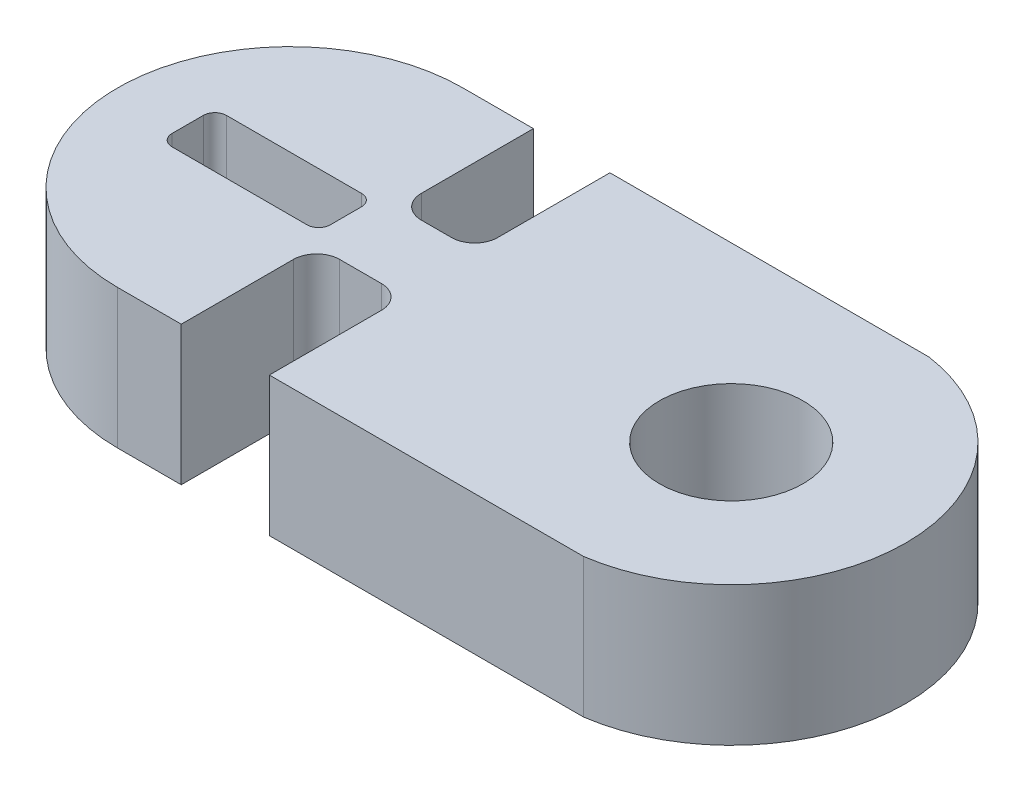
ISO-10303-21;
HEADER;
FILE_DESCRIPTION(('STEP AP214'),'2;1');
FILE_NAME('part.step','',(''),(''),'','','');
FILE_SCHEMA(('AUTOMOTIVE_DESIGN { 1 0 10303 214 1 1 1 1 }'));
ENDSEC;
DATA;
#1=APPLICATION_CONTEXT('core data for automotive mechanical design processes');
#2=APPLICATION_PROTOCOL_DEFINITION('international standard','automotive_design',2000,#1);
#3=PRODUCT_CONTEXT('',#1,'mechanical');
#4=PRODUCT('Part','Part','',(#3));
#5=PRODUCT_RELATED_PRODUCT_CATEGORY('part','',(#4));
#6=PRODUCT_DEFINITION_FORMATION('','',#4);
#7=PRODUCT_DEFINITION_CONTEXT('part definition',#1,'design');
#8=PRODUCT_DEFINITION('design','',#6,#7);
#9=PRODUCT_DEFINITION_SHAPE('','',#8);
#10=(LENGTH_UNIT() NAMED_UNIT(*) SI_UNIT(.MILLI.,.METRE.));
#11=(NAMED_UNIT(*) PLANE_ANGLE_UNIT() SI_UNIT($,.RADIAN.));
#12=(NAMED_UNIT(*) SI_UNIT($,.STERADIAN.) SOLID_ANGLE_UNIT());
#13=UNCERTAINTY_MEASURE_WITH_UNIT(LENGTH_MEASURE(1.E-05),#10,'distance_accuracy_value','');
#14=(GEOMETRIC_REPRESENTATION_CONTEXT(3) GLOBAL_UNCERTAINTY_ASSIGNED_CONTEXT((#13)) GLOBAL_UNIT_ASSIGNED_CONTEXT((#10,
#11,#12)) REPRESENTATION_CONTEXT('',''));
#15=CARTESIAN_POINT('',(0.,0.,0.));
#16=DIRECTION('',(0.,0.,1.));
#17=DIRECTION('',(1.,0.,0.));
#18=AXIS2_PLACEMENT_3D('',#15,#16,#17);
#19=CARTESIAN_POINT('',(-10.05,6.,0.));
#20=DIRECTION('',(0.,1.,0.));
#21=DIRECTION('',(0.,0.,1.));
#22=AXIS2_PLACEMENT_3D('',#19,#20,#21);
#23=PLANE('',#22);
#24=DIRECTION('',(0.,0.,-1.));
#25=VECTOR('',#24,1.);
#26=CARTESIAN_POINT('',(-7.79626507803803,6.,1.02582435237344));
#27=LINE('',#26,#25);
#28=CARTESIAN_POINT('',(-7.79626507803803,6.,0.525824352373436));
#29=VERTEX_POINT('',#28);
#30=CARTESIAN_POINT('',(-7.79626507803803,6.,-0.824245982154812));
#31=VERTEX_POINT('',#30);
#32=EDGE_CURVE('E305',#29,#31,#27,.T.);
#33=ORIENTED_EDGE('',*,*,#32,.F.);
#34=CARTESIAN_POINT('',(-8.29626507803803,6.,0.525824352373436));
#35=DIRECTION('',(0.,1.,0.));
#36=DIRECTION('',(0.,0.,1.));
#37=AXIS2_PLACEMENT_3D('',#34,#35,#36);
#38=CIRCLE('',#37,0.5);
#39=CARTESIAN_POINT('',(-8.29626507803803,6.,1.02582435237344));
#40=VERTEX_POINT('',#39);
#41=EDGE_CURVE('E290',#29,#40,#38,.F.);
#42=ORIENTED_EDGE('',*,*,#41,.T.);
#43=DIRECTION('',(1.,0.,0.));
#44=VECTOR('',#43,1.);
#45=CARTESIAN_POINT('',(-14.6226598592866,6.,1.02582435237344));
#46=LINE('',#45,#44);
#47=CARTESIAN_POINT('',(-14.1226598592866,6.,1.02582435237344));
#48=VERTEX_POINT('',#47);
#49=EDGE_CURVE('E330',#48,#40,#46,.T.);
#50=ORIENTED_EDGE('',*,*,#49,.F.);
#51=CARTESIAN_POINT('',(-14.1226598592866,6.,0.525824352373436));
#52=DIRECTION('',(0.,1.,0.));
#53=DIRECTION('',(0.,0.,1.));
#54=AXIS2_PLACEMENT_3D('',#51,#52,#53);
#55=CIRCLE('',#54,0.5);
#56=CARTESIAN_POINT('',(-14.6226598592866,6.,0.525824352373436));
#57=VERTEX_POINT('',#56);
#58=EDGE_CURVE('E298',#48,#57,#55,.F.);
#59=ORIENTED_EDGE('',*,*,#58,.T.);
#60=DIRECTION('',(0.,0.,1.));
#61=VECTOR('',#60,1.);
#62=CARTESIAN_POINT('',(-14.6226598592866,6.,1.02582435237344));
#63=LINE('',#62,#61);
#64=CARTESIAN_POINT('',(-14.6226598592866,6.,-0.824245982154812));
#65=VERTEX_POINT('',#64);
#66=EDGE_CURVE('E327',#65,#57,#63,.T.);
#67=ORIENTED_EDGE('',*,*,#66,.F.);
#68=CARTESIAN_POINT('',(-14.1226598592866,6.,-0.824245982154812));
#69=DIRECTION('',(0.,1.,0.));
#70=DIRECTION('',(0.,0.,1.));
#71=AXIS2_PLACEMENT_3D('',#68,#69,#70);
#72=CIRCLE('',#71,0.5);
#73=CARTESIAN_POINT('',(-14.1226598592866,6.,-1.32424598215481));
#74=VERTEX_POINT('',#73);
#75=EDGE_CURVE('E294',#65,#74,#72,.F.);
#76=ORIENTED_EDGE('',*,*,#75,.T.);
#77=DIRECTION('',(-1.,0.,0.));
#78=VECTOR('',#77,1.);
#79=CARTESIAN_POINT('',(-14.6226598592866,6.,-1.32424598215481));
#80=LINE('',#79,#78);
#81=CARTESIAN_POINT('',(-8.29626507803803,6.,-1.32424598215481));
#82=VERTEX_POINT('',#81);
#83=EDGE_CURVE('E306',#82,#74,#80,.T.);
#84=ORIENTED_EDGE('',*,*,#83,.F.);
#85=CARTESIAN_POINT('',(-8.29626507803803,6.,-0.824245982154812));
#86=DIRECTION('',(0.,1.,0.));
#87=DIRECTION('',(0.,0.,1.));
#88=AXIS2_PLACEMENT_3D('',#85,#86,#87);
#89=CIRCLE('',#88,0.5);
#90=EDGE_CURVE('E41',#82,#31,#89,.F.);
#91=ORIENTED_EDGE('',*,*,#90,.T.);
#92=EDGE_LOOP('',(#33,#42,#50,#59,#67,#76,#84,#91));
#93=FACE_BOUND('',#92,.T.);
#94=CARTESIAN_POINT('',(-10.05,6.,0.));
#95=DIRECTION('',(0.,1.,0.));
#96=DIRECTION('',(0.,0.,1.));
#97=AXIS2_PLACEMENT_3D('',#94,#95,#96);
#98=CIRCLE('',#97,7.45);
#99=CARTESIAN_POINT('',(-10.05,6.,-7.45));
#100=VERTEX_POINT('',#99);
#101=CARTESIAN_POINT('',(-10.05,6.,7.45));
#102=VERTEX_POINT('',#101);
#103=EDGE_CURVE('E206',#100,#102,#98,.T.);
#104=ORIENTED_EDGE('',*,*,#103,.T.);
#105=DIRECTION('',(1.,0.,0.));
#106=VECTOR('',#105,1.);
#107=CARTESIAN_POINT('',(-10.05,6.,7.45));
#108=LINE('',#107,#106);
#109=CARTESIAN_POINT('',(-7.3,6.,7.45));
#110=VERTEX_POINT('',#109);
#111=EDGE_CURVE('E194',#102,#110,#108,.T.);
#112=ORIENTED_EDGE('',*,*,#111,.T.);
#113=DIRECTION('',(0.,0.,-1.));
#114=VECTOR('',#113,1.);
#115=CARTESIAN_POINT('',(-7.3,6.,7.45));
#116=LINE('',#115,#114);
#117=CARTESIAN_POINT('',(-7.3,6.,2.61409383119895));
#118=VERTEX_POINT('',#117);
#119=EDGE_CURVE('E205',#110,#118,#116,.T.);
#120=ORIENTED_EDGE('',*,*,#119,.T.);
#121=CARTESIAN_POINT('',(-6.3,6.,2.61409383119895));
#122=DIRECTION('',(0.,1.,0.));
#123=DIRECTION('',(0.,0.,1.));
#124=AXIS2_PLACEMENT_3D('',#121,#122,#123);
#125=CIRCLE('',#124,1.);
#126=CARTESIAN_POINT('',(-6.3,6.,1.61409383119895));
#127=VERTEX_POINT('',#126);
#128=EDGE_CURVE('E261',#118,#127,#125,.F.);
#129=ORIENTED_EDGE('',*,*,#128,.T.);
#130=DIRECTION('',(1.,0.,0.));
#131=VECTOR('',#130,1.);
#132=CARTESIAN_POINT('',(-7.3,6.,1.61409383119895));
#133=LINE('',#132,#131);
#134=CARTESIAN_POINT('',(-4.5,6.,1.61409383119895));
#135=VERTEX_POINT('',#134);
#136=EDGE_CURVE('E343',#127,#135,#133,.T.);
#137=ORIENTED_EDGE('',*,*,#136,.T.);
#138=CARTESIAN_POINT('',(-4.5,6.,2.61409383119895));
#139=DIRECTION('',(0.,1.,0.));
#140=DIRECTION('',(0.,0.,1.));
#141=AXIS2_PLACEMENT_3D('',#138,#139,#140);
#142=CIRCLE('',#141,1.);
#143=CARTESIAN_POINT('',(-3.5,6.,2.61409383119895));
#144=VERTEX_POINT('',#143);
#145=EDGE_CURVE('E257',#135,#144,#142,.F.);
#146=ORIENTED_EDGE('',*,*,#145,.T.);
#147=DIRECTION('',(0.,0.,1.));
#148=VECTOR('',#147,1.);
#149=CARTESIAN_POINT('',(-3.5,6.,7.45));
#150=LINE('',#149,#148);
#151=CARTESIAN_POINT('',(-3.5,6.,7.45));
#152=VERTEX_POINT('',#151);
#153=EDGE_CURVE('E346',#144,#152,#150,.T.);
#154=ORIENTED_EDGE('',*,*,#153,.T.);
#155=DIRECTION('',(1.,0.,0.));
#156=VECTOR('',#155,1.);
#157=CARTESIAN_POINT('',(-3.5,6.,7.45));
#158=LINE('',#157,#156);
#159=CARTESIAN_POINT('',(10.05,6.,7.45));
#160=VERTEX_POINT('',#159);
#161=EDGE_CURVE('E348',#152,#160,#158,.T.);
#162=ORIENTED_EDGE('',*,*,#161,.T.);
#163=CARTESIAN_POINT('',(8.97248062015504,6.,0.));
#164=DIRECTION('',(0.,1.,0.));
#165=DIRECTION('',(0.,0.,1.));
#166=AXIS2_PLACEMENT_3D('',#163,#164,#165);
#167=CIRCLE('',#166,7.52751937984496);
#168=CARTESIAN_POINT('',(10.05,6.,-7.45));
#169=VERTEX_POINT('',#168);
#170=EDGE_CURVE('E350',#160,#169,#167,.T.);
#171=ORIENTED_EDGE('',*,*,#170,.T.);
#172=DIRECTION('',(-1.,0.,0.));
#173=VECTOR('',#172,1.);
#174=CARTESIAN_POINT('',(-3.71,6.,-7.45));
#175=LINE('',#174,#173);
#176=CARTESIAN_POINT('',(-3.71,6.,-7.45));
#177=VERTEX_POINT('',#176);
#178=EDGE_CURVE('E352',#169,#177,#175,.T.);
#179=ORIENTED_EDGE('',*,*,#178,.T.);
#180=DIRECTION('',(0.,0.,1.));
#181=VECTOR('',#180,1.);
#182=CARTESIAN_POINT('',(-3.71,6.,-7.45));
#183=LINE('',#182,#181);
#184=CARTESIAN_POINT('',(-3.71,6.,-2.61409383119895));
#185=VERTEX_POINT('',#184);
#186=EDGE_CURVE('E354',#177,#185,#183,.T.);
#187=ORIENTED_EDGE('',*,*,#186,.T.);
#188=CARTESIAN_POINT('',(-4.71,6.,-2.61409383119895));
#189=DIRECTION('',(0.,1.,0.));
#190=DIRECTION('',(0.,0.,1.));
#191=AXIS2_PLACEMENT_3D('',#188,#189,#190);
#192=CIRCLE('',#191,1.);
#193=CARTESIAN_POINT('',(-4.71,6.,-1.61409383119895));
#194=VERTEX_POINT('',#193);
#195=EDGE_CURVE('E265',#185,#194,#192,.F.);
#196=ORIENTED_EDGE('',*,*,#195,.T.);
#197=DIRECTION('',(-1.,0.,0.));
#198=VECTOR('',#197,1.);
#199=CARTESIAN_POINT('',(-7.01,6.,-1.61409383119895));
#200=LINE('',#199,#198);
#201=CARTESIAN_POINT('',(-6.01,6.,-1.61409383119895));
#202=VERTEX_POINT('',#201);
#203=EDGE_CURVE('E357',#194,#202,#200,.T.);
#204=ORIENTED_EDGE('',*,*,#203,.T.);
#205=CARTESIAN_POINT('',(-6.01,6.,-2.61409383119895));
#206=DIRECTION('',(0.,1.,0.));
#207=DIRECTION('',(0.,0.,1.));
#208=AXIS2_PLACEMENT_3D('',#205,#206,#207);
#209=CIRCLE('',#208,1.);
#210=CARTESIAN_POINT('',(-7.01,6.,-2.61409383119895));
#211=VERTEX_POINT('',#210);
#212=EDGE_CURVE('E269',#202,#211,#209,.F.);
#213=ORIENTED_EDGE('',*,*,#212,.T.);
#214=DIRECTION('',(0.,0.,-1.));
#215=VECTOR('',#214,1.);
#216=CARTESIAN_POINT('',(-7.01,6.,-7.45));
#217=LINE('',#216,#215);
#218=CARTESIAN_POINT('',(-7.01,6.,-7.45));
#219=VERTEX_POINT('',#218);
#220=EDGE_CURVE('E360',#211,#219,#217,.T.);
#221=ORIENTED_EDGE('',*,*,#220,.T.);
#222=DIRECTION('',(-1.,0.,0.));
#223=VECTOR('',#222,1.);
#224=CARTESIAN_POINT('',(-10.05,6.,-7.45));
#225=LINE('',#224,#223);
#226=EDGE_CURVE('E211',#219,#100,#225,.T.);
#227=ORIENTED_EDGE('',*,*,#226,.T.);
#228=EDGE_LOOP('',(#104,#112,#120,#129,#137,#146,#154,#162,#171,#179,#187,#196,#204,#213,#221,#227));
#229=FACE_BOUND('',#228,.T.);
#230=CARTESIAN_POINT('',(8.97248062015504,6.,0.));
#231=DIRECTION('',(0.,1.,0.));
#232=DIRECTION('',(0.,0.,1.));
#233=AXIS2_PLACEMENT_3D('',#230,#231,#232);
#234=CIRCLE('',#233,3.1);
#235=CARTESIAN_POINT('',(8.97248062015504,6.,3.1));
#236=VERTEX_POINT('',#235);
#237=EDGE_CURVE('E337',#236,#236,#234,.T.);
#238=ORIENTED_EDGE('',*,*,#237,.F.);
#239=EDGE_LOOP('',(#238));
#240=FACE_BOUND('',#239,.T.);
#241=ADVANCED_FACE('F33',(#93,#229,#240),#23,.T.);
#242=CARTESIAN_POINT('',(-10.05,0.,0.));
#243=DIRECTION('',(0.,1.,0.));
#244=DIRECTION('',(0.,0.,1.));
#245=AXIS2_PLACEMENT_3D('',#242,#243,#244);
#246=PLANE('',#245);
#247=DIRECTION('',(0.,0.,1.));
#248=VECTOR('',#247,1.);
#249=CARTESIAN_POINT('',(-14.6226598592866,0.,0.));
#250=LINE('',#249,#248);
#251=CARTESIAN_POINT('',(-14.6226598592866,0.,-0.824245982154812));
#252=VERTEX_POINT('',#251);
#253=CARTESIAN_POINT('',(-14.6226598592866,0.,0.525824352373436));
#254=VERTEX_POINT('',#253);
#255=EDGE_CURVE('E222',#252,#254,#250,.T.);
#256=ORIENTED_EDGE('',*,*,#255,.T.);
#257=CARTESIAN_POINT('',(-14.1226598592866,0.,0.525824352373436));
#258=DIRECTION('',(0.,1.,0.));
#259=DIRECTION('',(0.,0.,1.));
#260=AXIS2_PLACEMENT_3D('',#257,#258,#259);
#261=CIRCLE('',#260,0.5);
#262=CARTESIAN_POINT('',(-14.1226598592866,0.,1.02582435237344));
#263=VERTEX_POINT('',#262);
#264=EDGE_CURVE('E300',#254,#263,#261,.T.);
#265=ORIENTED_EDGE('',*,*,#264,.T.);
#266=DIRECTION('',(1.,0.,0.));
#267=VECTOR('',#266,1.);
#268=CARTESIAN_POINT('',(-10.05,0.,1.02582435237344));
#269=LINE('',#268,#267);
#270=CARTESIAN_POINT('',(-8.29626507803803,0.,1.02582435237344));
#271=VERTEX_POINT('',#270);
#272=EDGE_CURVE('E230',#263,#271,#269,.T.);
#273=ORIENTED_EDGE('',*,*,#272,.T.);
#274=CARTESIAN_POINT('',(-8.29626507803803,0.,0.525824352373436));
#275=DIRECTION('',(0.,1.,0.));
#276=DIRECTION('',(0.,0.,1.));
#277=AXIS2_PLACEMENT_3D('',#274,#275,#276);
#278=CIRCLE('',#277,0.5);
#279=CARTESIAN_POINT('',(-7.79626507803803,0.,0.525824352373436));
#280=VERTEX_POINT('',#279);
#281=EDGE_CURVE('E292',#271,#280,#278,.T.);
#282=ORIENTED_EDGE('',*,*,#281,.T.);
#283=DIRECTION('',(0.,0.,-1.));
#284=VECTOR('',#283,1.);
#285=CARTESIAN_POINT('',(-7.79626507803803,0.,0.));
#286=LINE('',#285,#284);
#287=CARTESIAN_POINT('',(-7.79626507803803,0.,-0.824245982154812));
#288=VERTEX_POINT('',#287);
#289=EDGE_CURVE('E233',#280,#288,#286,.T.);
#290=ORIENTED_EDGE('',*,*,#289,.T.);
#291=CARTESIAN_POINT('',(-8.29626507803803,0.,-0.824245982154812));
#292=DIRECTION('',(0.,1.,0.));
#293=DIRECTION('',(0.,0.,1.));
#294=AXIS2_PLACEMENT_3D('',#291,#292,#293);
#295=CIRCLE('',#294,0.5);
#296=CARTESIAN_POINT('',(-8.29626507803803,0.,-1.32424598215481));
#297=VERTEX_POINT('',#296);
#298=EDGE_CURVE('E11',#288,#297,#295,.T.);
#299=ORIENTED_EDGE('',*,*,#298,.T.);
#300=DIRECTION('',(-1.,0.,0.));
#301=VECTOR('',#300,1.);
#302=CARTESIAN_POINT('',(-10.05,0.,-1.32424598215481));
#303=LINE('',#302,#301);
#304=CARTESIAN_POINT('',(-14.1226598592866,0.,-1.32424598215481));
#305=VERTEX_POINT('',#304);
#306=EDGE_CURVE('E220',#297,#305,#303,.T.);
#307=ORIENTED_EDGE('',*,*,#306,.T.);
#308=CARTESIAN_POINT('',(-14.1226598592866,0.,-0.824245982154812));
#309=DIRECTION('',(0.,1.,0.));
#310=DIRECTION('',(0.,0.,1.));
#311=AXIS2_PLACEMENT_3D('',#308,#309,#310);
#312=CIRCLE('',#311,0.5);
#313=EDGE_CURVE('E296',#305,#252,#312,.T.);
#314=ORIENTED_EDGE('',*,*,#313,.T.);
#315=EDGE_LOOP('',(#256,#265,#273,#282,#290,#299,#307,#314));
#316=FACE_BOUND('',#315,.T.);
#317=CARTESIAN_POINT('',(-10.05,0.,0.));
#318=DIRECTION('',(0.,1.,0.));
#319=DIRECTION('',(0.,0.,1.));
#320=AXIS2_PLACEMENT_3D('',#317,#318,#319);
#321=CIRCLE('',#320,7.45);
#322=CARTESIAN_POINT('',(-10.05,0.,-7.45));
#323=VERTEX_POINT('',#322);
#324=CARTESIAN_POINT('',(-10.05,0.,7.45));
#325=VERTEX_POINT('',#324);
#326=EDGE_CURVE('E219',#323,#325,#321,.T.);
#327=ORIENTED_EDGE('',*,*,#326,.F.);
#328=DIRECTION('',(-1.,0.,0.));
#329=VECTOR('',#328,1.);
#330=CARTESIAN_POINT('',(-10.05,0.,-7.45));
#331=LINE('',#330,#329);
#332=CARTESIAN_POINT('',(-7.01,0.,-7.45));
#333=VERTEX_POINT('',#332);
#334=EDGE_CURVE('E215',#333,#323,#331,.T.);
#335=ORIENTED_EDGE('',*,*,#334,.F.);
#336=DIRECTION('',(0.,0.,-1.));
#337=VECTOR('',#336,1.);
#338=CARTESIAN_POINT('',(-7.01,0.,-7.45));
#339=LINE('',#338,#337);
#340=CARTESIAN_POINT('',(-7.01,0.,-2.61409383119895));
#341=VERTEX_POINT('',#340);
#342=EDGE_CURVE('E387',#341,#333,#339,.T.);
#343=ORIENTED_EDGE('',*,*,#342,.F.);
#344=CARTESIAN_POINT('',(-6.01,0.,-2.61409383119895));
#345=DIRECTION('',(0.,1.,0.));
#346=DIRECTION('',(0.,0.,1.));
#347=AXIS2_PLACEMENT_3D('',#344,#345,#346);
#348=CIRCLE('',#347,1.);
#349=CARTESIAN_POINT('',(-6.01,0.,-1.61409383119895));
#350=VERTEX_POINT('',#349);
#351=EDGE_CURVE('E267',#341,#350,#348,.T.);
#352=ORIENTED_EDGE('',*,*,#351,.T.);
#353=DIRECTION('',(-1.,0.,0.));
#354=VECTOR('',#353,1.);
#355=CARTESIAN_POINT('',(-7.01,0.,-1.61409383119895));
#356=LINE('',#355,#354);
#357=CARTESIAN_POINT('',(-4.71,0.,-1.61409383119895));
#358=VERTEX_POINT('',#357);
#359=EDGE_CURVE('E384',#358,#350,#356,.T.);
#360=ORIENTED_EDGE('',*,*,#359,.F.);
#361=CARTESIAN_POINT('',(-4.71,0.,-2.61409383119895));
#362=DIRECTION('',(0.,1.,0.));
#363=DIRECTION('',(0.,0.,1.));
#364=AXIS2_PLACEMENT_3D('',#361,#362,#363);
#365=CIRCLE('',#364,1.);
#366=CARTESIAN_POINT('',(-3.71,0.,-2.61409383119895));
#367=VERTEX_POINT('',#366);
#368=EDGE_CURVE('E263',#358,#367,#365,.T.);
#369=ORIENTED_EDGE('',*,*,#368,.T.);
#370=DIRECTION('',(0.,0.,1.));
#371=VECTOR('',#370,1.);
#372=CARTESIAN_POINT('',(-3.71,0.,-7.45));
#373=LINE('',#372,#371);
#374=CARTESIAN_POINT('',(-3.71,0.,-7.45));
#375=VERTEX_POINT('',#374);
#376=EDGE_CURVE('E381',#375,#367,#373,.T.);
#377=ORIENTED_EDGE('',*,*,#376,.F.);
#378=DIRECTION('',(-1.,0.,0.));
#379=VECTOR('',#378,1.);
#380=CARTESIAN_POINT('',(-3.71,0.,-7.45));
#381=LINE('',#380,#379);
#382=CARTESIAN_POINT('',(10.05,0.,-7.45));
#383=VERTEX_POINT('',#382);
#384=EDGE_CURVE('E379',#383,#375,#381,.T.);
#385=ORIENTED_EDGE('',*,*,#384,.F.);
#386=CARTESIAN_POINT('',(8.97248062015504,0.,0.));
#387=DIRECTION('',(0.,1.,0.));
#388=DIRECTION('',(0.,0.,1.));
#389=AXIS2_PLACEMENT_3D('',#386,#387,#388);
#390=CIRCLE('',#389,7.52751937984496);
#391=CARTESIAN_POINT('',(10.05,0.,7.45));
#392=VERTEX_POINT('',#391);
#393=EDGE_CURVE('E377',#392,#383,#390,.T.);
#394=ORIENTED_EDGE('',*,*,#393,.F.);
#395=DIRECTION('',(1.,0.,0.));
#396=VECTOR('',#395,1.);
#397=CARTESIAN_POINT('',(-3.5,0.,7.45));
#398=LINE('',#397,#396);
#399=CARTESIAN_POINT('',(-3.5,0.,7.45));
#400=VERTEX_POINT('',#399);
#401=EDGE_CURVE('E375',#400,#392,#398,.T.);
#402=ORIENTED_EDGE('',*,*,#401,.F.);
#403=DIRECTION('',(0.,0.,1.));
#404=VECTOR('',#403,1.);
#405=CARTESIAN_POINT('',(-3.5,0.,7.45));
#406=LINE('',#405,#404);
#407=CARTESIAN_POINT('',(-3.5,0.,2.61409383119895));
#408=VERTEX_POINT('',#407);
#409=EDGE_CURVE('E373',#408,#400,#406,.T.);
#410=ORIENTED_EDGE('',*,*,#409,.F.);
#411=CARTESIAN_POINT('',(-4.5,0.,2.61409383119895));
#412=DIRECTION('',(0.,1.,0.));
#413=DIRECTION('',(0.,0.,1.));
#414=AXIS2_PLACEMENT_3D('',#411,#412,#413);
#415=CIRCLE('',#414,1.);
#416=CARTESIAN_POINT('',(-4.5,0.,1.61409383119895));
#417=VERTEX_POINT('',#416);
#418=EDGE_CURVE('E255',#408,#417,#415,.T.);
#419=ORIENTED_EDGE('',*,*,#418,.T.);
#420=DIRECTION('',(1.,0.,0.));
#421=VECTOR('',#420,1.);
#422=CARTESIAN_POINT('',(-7.3,0.,1.61409383119895));
#423=LINE('',#422,#421);
#424=CARTESIAN_POINT('',(-6.3,0.,1.61409383119895));
#425=VERTEX_POINT('',#424);
#426=EDGE_CURVE('E370',#425,#417,#423,.T.);
#427=ORIENTED_EDGE('',*,*,#426,.F.);
#428=CARTESIAN_POINT('',(-6.3,0.,2.61409383119895));
#429=DIRECTION('',(0.,1.,0.));
#430=DIRECTION('',(0.,0.,1.));
#431=AXIS2_PLACEMENT_3D('',#428,#429,#430);
#432=CIRCLE('',#431,1.);
#433=CARTESIAN_POINT('',(-7.3,0.,2.61409383119895));
#434=VERTEX_POINT('',#433);
#435=EDGE_CURVE('E259',#425,#434,#432,.T.);
#436=ORIENTED_EDGE('',*,*,#435,.T.);
#437=DIRECTION('',(0.,0.,-1.));
#438=VECTOR('',#437,1.);
#439=CARTESIAN_POINT('',(-7.3,0.,7.45));
#440=LINE('',#439,#438);
#441=CARTESIAN_POINT('',(-7.3,0.,7.45));
#442=VERTEX_POINT('',#441);
#443=EDGE_CURVE('E367',#442,#434,#440,.T.);
#444=ORIENTED_EDGE('',*,*,#443,.F.);
#445=DIRECTION('',(1.,0.,0.));
#446=VECTOR('',#445,1.);
#447=CARTESIAN_POINT('',(-10.05,0.,7.45));
#448=LINE('',#447,#446);
#449=EDGE_CURVE('E365',#325,#442,#448,.T.);
#450=ORIENTED_EDGE('',*,*,#449,.F.);
#451=EDGE_LOOP('',(#327,#335,#343,#352,#360,#369,#377,#385,#394,#402,#410,#419,#427,#436,#444,#450));
#452=FACE_BOUND('',#451,.T.);
#453=CARTESIAN_POINT('',(8.97248062015504,0.,0.));
#454=DIRECTION('',(0.,1.,0.));
#455=DIRECTION('',(0.,0.,1.));
#456=AXIS2_PLACEMENT_3D('',#453,#454,#455);
#457=CIRCLE('',#456,3.1);
#458=CARTESIAN_POINT('',(8.97248062015504,0.,3.1));
#459=VERTEX_POINT('',#458);
#460=EDGE_CURVE('E333',#459,#459,#457,.T.);
#461=ORIENTED_EDGE('',*,*,#460,.T.);
#462=EDGE_LOOP('',(#461));
#463=FACE_BOUND('',#462,.T.);
#464=ADVANCED_FACE('F317',(#316,#452,#463),#246,.F.);
#465=CARTESIAN_POINT('',(-10.05,6.,0.));
#466=DIRECTION('',(0.,-1.,0.));
#467=DIRECTION('',(0.,0.,-1.));
#468=AXIS2_PLACEMENT_3D('',#465,#466,#467);
#469=CYLINDRICAL_SURFACE('',#468,7.45);
#470=ORIENTED_EDGE('',*,*,#326,.T.);
#471=DIRECTION('',(0.,-1.,0.));
#472=VECTOR('',#471,1.);
#473=CARTESIAN_POINT('',(-10.05,6.,7.45));
#474=LINE('',#473,#472);
#475=EDGE_CURVE('E198',#102,#325,#474,.T.);
#476=ORIENTED_EDGE('',*,*,#475,.F.);
#477=ORIENTED_EDGE('',*,*,#103,.F.);
#478=DIRECTION('',(0.,-1.,0.));
#479=VECTOR('',#478,1.);
#480=CARTESIAN_POINT('',(-10.05,6.,-7.45));
#481=LINE('',#480,#479);
#482=EDGE_CURVE('E363',#100,#323,#481,.T.);
#483=ORIENTED_EDGE('',*,*,#482,.T.);
#484=EDGE_LOOP('',(#470,#476,#477,#483));
#485=FACE_BOUND('',#484,.T.);
#486=ADVANCED_FACE('F217',(#485),#469,.T.);
#487=CARTESIAN_POINT('',(-10.05,6.,7.45));
#488=DIRECTION('',(0.,0.,-1.));
#489=DIRECTION('',(-1.,0.,0.));
#490=AXIS2_PLACEMENT_3D('',#487,#488,#489);
#491=PLANE('',#490);
#492=ORIENTED_EDGE('',*,*,#449,.T.);
#493=DIRECTION('',(0.,-1.,0.));
#494=VECTOR('',#493,1.);
#495=CARTESIAN_POINT('',(-7.3,6.,7.45));
#496=LINE('',#495,#494);
#497=EDGE_CURVE('E201',#110,#442,#496,.T.);
#498=ORIENTED_EDGE('',*,*,#497,.F.);
#499=ORIENTED_EDGE('',*,*,#111,.F.);
#500=ORIENTED_EDGE('',*,*,#475,.T.);
#501=EDGE_LOOP('',(#492,#498,#499,#500));
#502=FACE_BOUND('',#501,.T.);
#503=ADVANCED_FACE('F196',(#502),#491,.F.);
#504=CARTESIAN_POINT('',(-7.3,6.,7.45));
#505=DIRECTION('',(-1.,0.,0.));
#506=DIRECTION('',(0.,0.,1.));
#507=AXIS2_PLACEMENT_3D('',#504,#505,#506);
#508=PLANE('',#507);
#509=ORIENTED_EDGE('',*,*,#443,.T.);
#510=DIRECTION('',(0.,-1.,0.));
#511=VECTOR('',#510,1.);
#512=CARTESIAN_POINT('',(-7.3,6.,2.61409383119895));
#513=LINE('',#512,#511);
#514=EDGE_CURVE('E243',#434,#118,#513,.F.);
#515=ORIENTED_EDGE('',*,*,#514,.T.);
#516=ORIENTED_EDGE('',*,*,#119,.F.);
#517=ORIENTED_EDGE('',*,*,#497,.T.);
#518=EDGE_LOOP('',(#509,#515,#516,#517));
#519=FACE_BOUND('',#518,.T.);
#520=ADVANCED_FACE('F443',(#519),#508,.F.);
#521=CARTESIAN_POINT('',(-7.3,6.,1.61409383119895));
#522=DIRECTION('',(0.,0.,-1.));
#523=DIRECTION('',(-1.,0.,0.));
#524=AXIS2_PLACEMENT_3D('',#521,#522,#523);
#525=PLANE('',#524);
#526=ORIENTED_EDGE('',*,*,#426,.T.);
#527=DIRECTION('',(0.,-1.,0.));
#528=VECTOR('',#527,1.);
#529=CARTESIAN_POINT('',(-4.5,6.,1.61409383119895));
#530=LINE('',#529,#528);
#531=EDGE_CURVE('E241',#417,#135,#530,.F.);
#532=ORIENTED_EDGE('',*,*,#531,.T.);
#533=ORIENTED_EDGE('',*,*,#136,.F.);
#534=DIRECTION('',(0.,-1.,0.));
#535=VECTOR('',#534,1.);
#536=CARTESIAN_POINT('',(-6.3,0.,1.61409383119895));
#537=LINE('',#536,#535);
#538=EDGE_CURVE('E238',#127,#425,#537,.T.);
#539=ORIENTED_EDGE('',*,*,#538,.T.);
#540=EDGE_LOOP('',(#526,#532,#533,#539));
#541=FACE_BOUND('',#540,.T.);
#542=ADVANCED_FACE('F434',(#541),#525,.F.);
#543=CARTESIAN_POINT('',(-3.5,6.,7.45));
#544=DIRECTION('',(1.,0.,0.));
#545=DIRECTION('',(0.,0.,-1.));
#546=AXIS2_PLACEMENT_3D('',#543,#544,#545);
#547=PLANE('',#546);
#548=ORIENTED_EDGE('',*,*,#153,.F.);
#549=DIRECTION('',(0.,-1.,0.));
#550=VECTOR('',#549,1.);
#551=CARTESIAN_POINT('',(-3.5,0.,2.61409383119895));
#552=LINE('',#551,#550);
#553=EDGE_CURVE('E235',#144,#408,#552,.T.);
#554=ORIENTED_EDGE('',*,*,#553,.T.);
#555=ORIENTED_EDGE('',*,*,#409,.T.);
#556=DIRECTION('',(0.,-1.,0.));
#557=VECTOR('',#556,1.);
#558=CARTESIAN_POINT('',(-3.5,6.,7.45));
#559=LINE('',#558,#557);
#560=EDGE_CURVE('E224',#152,#400,#559,.T.);
#561=ORIENTED_EDGE('',*,*,#560,.F.);
#562=EDGE_LOOP('',(#548,#554,#555,#561));
#563=FACE_BOUND('',#562,.T.);
#564=ADVANCED_FACE('F428',(#563),#547,.F.);
#565=CARTESIAN_POINT('',(-3.5,6.,7.45));
#566=DIRECTION('',(0.,0.,-1.));
#567=DIRECTION('',(-1.,0.,0.));
#568=AXIS2_PLACEMENT_3D('',#565,#566,#567);
#569=PLANE('',#568);
#570=ORIENTED_EDGE('',*,*,#401,.T.);
#571=DIRECTION('',(0.,-1.,0.));
#572=VECTOR('',#571,1.);
#573=CARTESIAN_POINT('',(10.05,6.,7.45));
#574=LINE('',#573,#572);
#575=EDGE_CURVE('E400',#160,#392,#574,.T.);
#576=ORIENTED_EDGE('',*,*,#575,.F.);
#577=ORIENTED_EDGE('',*,*,#161,.F.);
#578=ORIENTED_EDGE('',*,*,#560,.T.);
#579=EDGE_LOOP('',(#570,#576,#577,#578));
#580=FACE_BOUND('',#579,.T.);
#581=ADVANCED_FACE('F407',(#580),#569,.F.);
#582=CARTESIAN_POINT('',(8.97248062015504,6.,0.));
#583=DIRECTION('',(0.,-1.,0.));
#584=DIRECTION('',(0.,0.,-1.));
#585=AXIS2_PLACEMENT_3D('',#582,#583,#584);
#586=CYLINDRICAL_SURFACE('',#585,7.52751937984496);
#587=ORIENTED_EDGE('',*,*,#393,.T.);
#588=DIRECTION('',(0.,-1.,0.));
#589=VECTOR('',#588,1.);
#590=CARTESIAN_POINT('',(10.05,6.,-7.45));
#591=LINE('',#590,#589);
#592=EDGE_CURVE('E397',#169,#383,#591,.T.);
#593=ORIENTED_EDGE('',*,*,#592,.F.);
#594=ORIENTED_EDGE('',*,*,#170,.F.);
#595=ORIENTED_EDGE('',*,*,#575,.T.);
#596=EDGE_LOOP('',(#587,#593,#594,#595));
#597=FACE_BOUND('',#596,.T.);
#598=ADVANCED_FACE('F418',(#597),#586,.T.);
#599=CARTESIAN_POINT('',(-3.71,6.,-7.45));
#600=DIRECTION('',(0.,0.,1.));
#601=DIRECTION('',(1.,0.,0.));
#602=AXIS2_PLACEMENT_3D('',#599,#600,#601);
#603=PLANE('',#602);
#604=ORIENTED_EDGE('',*,*,#384,.T.);
#605=DIRECTION('',(0.,-1.,0.));
#606=VECTOR('',#605,1.);
#607=CARTESIAN_POINT('',(-3.71,6.,-7.45));
#608=LINE('',#607,#606);
#609=EDGE_CURVE('E394',#177,#375,#608,.T.);
#610=ORIENTED_EDGE('',*,*,#609,.F.);
#611=ORIENTED_EDGE('',*,*,#178,.F.);
#612=ORIENTED_EDGE('',*,*,#592,.T.);
#613=EDGE_LOOP('',(#604,#610,#611,#612));
#614=FACE_BOUND('',#613,.T.);
#615=ADVANCED_FACE('F422',(#614),#603,.F.);
#616=CARTESIAN_POINT('',(-3.71,6.,-7.45));
#617=DIRECTION('',(1.,0.,0.));
#618=DIRECTION('',(0.,0.,-1.));
#619=AXIS2_PLACEMENT_3D('',#616,#617,#618);
#620=PLANE('',#619);
#621=ORIENTED_EDGE('',*,*,#376,.T.);
#622=DIRECTION('',(0.,-1.,0.));
#623=VECTOR('',#622,1.);
#624=CARTESIAN_POINT('',(-3.71,6.,-2.61409383119895));
#625=LINE('',#624,#623);
#626=EDGE_CURVE('E250',#367,#185,#625,.F.);
#627=ORIENTED_EDGE('',*,*,#626,.T.);
#628=ORIENTED_EDGE('',*,*,#186,.F.);
#629=ORIENTED_EDGE('',*,*,#609,.T.);
#630=EDGE_LOOP('',(#621,#627,#628,#629));
#631=FACE_BOUND('',#630,.T.);
#632=ADVANCED_FACE('F473',(#631),#620,.F.);
#633=CARTESIAN_POINT('',(-7.01,6.,-1.61409383119895));
#634=DIRECTION('',(0.,0.,1.));
#635=DIRECTION('',(1.,0.,0.));
#636=AXIS2_PLACEMENT_3D('',#633,#634,#635);
#637=PLANE('',#636);
#638=ORIENTED_EDGE('',*,*,#203,.F.);
#639=DIRECTION('',(0.,-1.,0.));
#640=VECTOR('',#639,1.);
#641=CARTESIAN_POINT('',(-4.71,0.,-1.61409383119895));
#642=LINE('',#641,#640);
#643=EDGE_CURVE('E247',#194,#358,#642,.T.);
#644=ORIENTED_EDGE('',*,*,#643,.T.);
#645=ORIENTED_EDGE('',*,*,#359,.T.);
#646=DIRECTION('',(0.,-1.,0.));
#647=VECTOR('',#646,1.);
#648=CARTESIAN_POINT('',(-6.01,6.,-1.61409383119895));
#649=LINE('',#648,#647);
#650=EDGE_CURVE('E245',#350,#202,#649,.F.);
#651=ORIENTED_EDGE('',*,*,#650,.T.);
#652=EDGE_LOOP('',(#638,#644,#645,#651));
#653=FACE_BOUND('',#652,.T.);
#654=ADVANCED_FACE('F469',(#653),#637,.F.);
#655=CARTESIAN_POINT('',(-7.01,6.,-7.45));
#656=DIRECTION('',(-1.,0.,0.));
#657=DIRECTION('',(0.,0.,1.));
#658=AXIS2_PLACEMENT_3D('',#655,#656,#657);
#659=PLANE('',#658);
#660=ORIENTED_EDGE('',*,*,#220,.F.);
#661=DIRECTION('',(0.,-1.,0.));
#662=VECTOR('',#661,1.);
#663=CARTESIAN_POINT('',(-7.01,0.,-2.61409383119895));
#664=LINE('',#663,#662);
#665=EDGE_CURVE('E252',#211,#341,#664,.T.);
#666=ORIENTED_EDGE('',*,*,#665,.T.);
#667=ORIENTED_EDGE('',*,*,#342,.T.);
#668=DIRECTION('',(0.,-1.,0.));
#669=VECTOR('',#668,1.);
#670=CARTESIAN_POINT('',(-7.01,6.,-7.45));
#671=LINE('',#670,#669);
#672=EDGE_CURVE('E391',#219,#333,#671,.T.);
#673=ORIENTED_EDGE('',*,*,#672,.F.);
#674=EDGE_LOOP('',(#660,#666,#667,#673));
#675=FACE_BOUND('',#674,.T.);
#676=ADVANCED_FACE('F465',(#675),#659,.F.);
#677=CARTESIAN_POINT('',(-10.05,6.,-7.45));
#678=DIRECTION('',(0.,0.,1.));
#679=DIRECTION('',(1.,0.,0.));
#680=AXIS2_PLACEMENT_3D('',#677,#678,#679);
#681=PLANE('',#680);
#682=ORIENTED_EDGE('',*,*,#334,.T.);
#683=ORIENTED_EDGE('',*,*,#482,.F.);
#684=ORIENTED_EDGE('',*,*,#226,.F.);
#685=ORIENTED_EDGE('',*,*,#672,.T.);
#686=EDGE_LOOP('',(#682,#683,#684,#685));
#687=FACE_BOUND('',#686,.T.);
#688=ADVANCED_FACE('F462',(#687),#681,.F.);
#689=CARTESIAN_POINT('',(8.97248062015504,6.,0.));
#690=DIRECTION('',(0.,-1.,0.));
#691=DIRECTION('',(0.,0.,-1.));
#692=AXIS2_PLACEMENT_3D('',#689,#690,#691);
#693=CYLINDRICAL_SURFACE('',#692,3.1);
#694=ORIENTED_EDGE('',*,*,#237,.T.);
#695=EDGE_LOOP('',(#694));
#696=FACE_BOUND('',#695,.T.);
#697=ORIENTED_EDGE('',*,*,#460,.F.);
#698=EDGE_LOOP('',(#697));
#699=FACE_BOUND('',#698,.T.);
#700=ADVANCED_FACE('F459',(#696,#699),#693,.F.);
#701=CARTESIAN_POINT('',(-7.79626507803803,-1.,1.02582435237344));
#702=DIRECTION('',(1.,0.,0.));
#703=DIRECTION('',(0.,0.,-1.));
#704=AXIS2_PLACEMENT_3D('',#701,#702,#703);
#705=PLANE('',#704);
#706=ORIENTED_EDGE('',*,*,#289,.F.);
#707=DIRECTION('',(0.,1.,0.));
#708=VECTOR('',#707,1.);
#709=CARTESIAN_POINT('',(-7.79626507803803,6.,0.525824352373436));
#710=LINE('',#709,#708);
#711=EDGE_CURVE('E273',#280,#29,#710,.T.);
#712=ORIENTED_EDGE('',*,*,#711,.T.);
#713=ORIENTED_EDGE('',*,*,#32,.T.);
#714=DIRECTION('',(0.,1.,0.));
#715=VECTOR('',#714,1.);
#716=CARTESIAN_POINT('',(-7.79626507803803,0.,-0.824245982154812));
#717=LINE('',#716,#715);
#718=EDGE_CURVE('E271',#31,#288,#717,.F.);
#719=ORIENTED_EDGE('',*,*,#718,.T.);
#720=EDGE_LOOP('',(#706,#712,#713,#719));
#721=FACE_BOUND('',#720,.T.);
#722=ADVANCED_FACE('F312',(#721),#705,.F.);
#723=CARTESIAN_POINT('',(-14.6226598592866,-1.,1.02582435237344));
#724=DIRECTION('',(0.,0.,1.));
#725=DIRECTION('',(1.,0.,0.));
#726=AXIS2_PLACEMENT_3D('',#723,#724,#725);
#727=PLANE('',#726);
#728=ORIENTED_EDGE('',*,*,#49,.T.);
#729=DIRECTION('',(0.,1.,0.));
#730=VECTOR('',#729,1.);
#731=CARTESIAN_POINT('',(-8.29626507803803,0.,1.02582435237344));
#732=LINE('',#731,#730);
#733=EDGE_CURVE('E279',#40,#271,#732,.F.);
#734=ORIENTED_EDGE('',*,*,#733,.T.);
#735=ORIENTED_EDGE('',*,*,#272,.F.);
#736=DIRECTION('',(0.,1.,0.));
#737=VECTOR('',#736,1.);
#738=CARTESIAN_POINT('',(-14.1226598592866,6.,1.02582435237344));
#739=LINE('',#738,#737);
#740=EDGE_CURVE('E276',#263,#48,#739,.T.);
#741=ORIENTED_EDGE('',*,*,#740,.T.);
#742=EDGE_LOOP('',(#728,#734,#735,#741));
#743=FACE_BOUND('',#742,.T.);
#744=ADVANCED_FACE('F531',(#743),#727,.F.);
#745=CARTESIAN_POINT('',(-14.6226598592866,-1.,1.02582435237344));
#746=DIRECTION('',(-1.,0.,0.));
#747=DIRECTION('',(0.,0.,1.));
#748=AXIS2_PLACEMENT_3D('',#745,#746,#747);
#749=PLANE('',#748);
#750=ORIENTED_EDGE('',*,*,#255,.F.);
#751=DIRECTION('',(0.,1.,0.));
#752=VECTOR('',#751,1.);
#753=CARTESIAN_POINT('',(-14.6226598592866,6.,-0.824245982154812));
#754=LINE('',#753,#752);
#755=EDGE_CURVE('E283',#252,#65,#754,.T.);
#756=ORIENTED_EDGE('',*,*,#755,.T.);
#757=ORIENTED_EDGE('',*,*,#66,.T.);
#758=DIRECTION('',(0.,1.,0.));
#759=VECTOR('',#758,1.);
#760=CARTESIAN_POINT('',(-14.6226598592866,0.,0.525824352373436));
#761=LINE('',#760,#759);
#762=EDGE_CURVE('E281',#57,#254,#761,.F.);
#763=ORIENTED_EDGE('',*,*,#762,.T.);
#764=EDGE_LOOP('',(#750,#756,#757,#763));
#765=FACE_BOUND('',#764,.T.);
#766=ADVANCED_FACE('F326',(#765),#749,.F.);
#767=CARTESIAN_POINT('',(-14.6226598592866,-1.,-1.32424598215481));
#768=DIRECTION('',(0.,0.,-1.));
#769=DIRECTION('',(-1.,0.,0.));
#770=AXIS2_PLACEMENT_3D('',#767,#768,#769);
#771=PLANE('',#770);
#772=ORIENTED_EDGE('',*,*,#83,.T.);
#773=DIRECTION('',(0.,1.,0.));
#774=VECTOR('',#773,1.);
#775=CARTESIAN_POINT('',(-14.1226598592866,0.,-1.32424598215481));
#776=LINE('',#775,#774);
#777=EDGE_CURVE('E48',#74,#305,#776,.F.);
#778=ORIENTED_EDGE('',*,*,#777,.T.);
#779=ORIENTED_EDGE('',*,*,#306,.F.);
#780=DIRECTION('',(0.,1.,0.));
#781=VECTOR('',#780,1.);
#782=CARTESIAN_POINT('',(-8.29626507803803,6.,-1.32424598215481));
#783=LINE('',#782,#781);
#784=EDGE_CURVE('E286',#297,#82,#783,.T.);
#785=ORIENTED_EDGE('',*,*,#784,.T.);
#786=EDGE_LOOP('',(#772,#778,#779,#785));
#787=FACE_BOUND('',#786,.T.);
#788=ADVANCED_FACE('F315',(#787),#771,.F.);
#789=CARTESIAN_POINT('',(-4.5,6.,2.61409383119895));
#790=DIRECTION('',(0.,1.,0.));
#791=DIRECTION('',(0.,0.,1.));
#792=AXIS2_PLACEMENT_3D('',#789,#790,#791);
#793=CYLINDRICAL_SURFACE('',#792,1.);
#794=ORIENTED_EDGE('',*,*,#145,.F.);
#795=ORIENTED_EDGE('',*,*,#531,.F.);
#796=ORIENTED_EDGE('',*,*,#418,.F.);
#797=ORIENTED_EDGE('',*,*,#553,.F.);
#798=EDGE_LOOP('',(#794,#795,#796,#797));
#799=FACE_BOUND('',#798,.T.);
#800=ADVANCED_FACE('F430',(#799),#793,.F.);
#801=CARTESIAN_POINT('',(-6.3,6.,2.61409383119895));
#802=DIRECTION('',(0.,1.,0.));
#803=DIRECTION('',(0.,0.,1.));
#804=AXIS2_PLACEMENT_3D('',#801,#802,#803);
#805=CYLINDRICAL_SURFACE('',#804,1.);
#806=ORIENTED_EDGE('',*,*,#128,.F.);
#807=ORIENTED_EDGE('',*,*,#514,.F.);
#808=ORIENTED_EDGE('',*,*,#435,.F.);
#809=ORIENTED_EDGE('',*,*,#538,.F.);
#810=EDGE_LOOP('',(#806,#807,#808,#809));
#811=FACE_BOUND('',#810,.T.);
#812=ADVANCED_FACE('F439',(#811),#805,.F.);
#813=CARTESIAN_POINT('',(-4.71,6.,-2.61409383119895));
#814=DIRECTION('',(0.,1.,0.));
#815=DIRECTION('',(0.,0.,1.));
#816=AXIS2_PLACEMENT_3D('',#813,#814,#815);
#817=CYLINDRICAL_SURFACE('',#816,1.);
#818=ORIENTED_EDGE('',*,*,#195,.F.);
#819=ORIENTED_EDGE('',*,*,#626,.F.);
#820=ORIENTED_EDGE('',*,*,#368,.F.);
#821=ORIENTED_EDGE('',*,*,#643,.F.);
#822=EDGE_LOOP('',(#818,#819,#820,#821));
#823=FACE_BOUND('',#822,.T.);
#824=ADVANCED_FACE('F563',(#823),#817,.F.);
#825=CARTESIAN_POINT('',(-6.01,6.,-2.61409383119895));
#826=DIRECTION('',(0.,1.,0.));
#827=DIRECTION('',(0.,0.,1.));
#828=AXIS2_PLACEMENT_3D('',#825,#826,#827);
#829=CYLINDRICAL_SURFACE('',#828,1.);
#830=ORIENTED_EDGE('',*,*,#212,.F.);
#831=ORIENTED_EDGE('',*,*,#650,.F.);
#832=ORIENTED_EDGE('',*,*,#351,.F.);
#833=ORIENTED_EDGE('',*,*,#665,.F.);
#834=EDGE_LOOP('',(#830,#831,#832,#833));
#835=FACE_BOUND('',#834,.T.);
#836=ADVANCED_FACE('F570',(#835),#829,.F.);
#837=CARTESIAN_POINT('',(-8.29626507803803,-1.,0.525824352373436));
#838=DIRECTION('',(0.,-1.,0.));
#839=DIRECTION('',(0.,0.,-1.));
#840=AXIS2_PLACEMENT_3D('',#837,#838,#839);
#841=CYLINDRICAL_SURFACE('',#840,0.5);
#842=ORIENTED_EDGE('',*,*,#281,.F.);
#843=ORIENTED_EDGE('',*,*,#733,.F.);
#844=ORIENTED_EDGE('',*,*,#41,.F.);
#845=ORIENTED_EDGE('',*,*,#711,.F.);
#846=EDGE_LOOP('',(#842,#843,#844,#845));
#847=FACE_BOUND('',#846,.T.);
#848=ADVANCED_FACE('F578',(#847),#841,.F.);
#849=CARTESIAN_POINT('',(-14.1226598592866,-1.,-0.824245982154812));
#850=DIRECTION('',(0.,-1.,0.));
#851=DIRECTION('',(0.,0.,-1.));
#852=AXIS2_PLACEMENT_3D('',#849,#850,#851);
#853=CYLINDRICAL_SURFACE('',#852,0.5);
#854=ORIENTED_EDGE('',*,*,#313,.F.);
#855=ORIENTED_EDGE('',*,*,#777,.F.);
#856=ORIENTED_EDGE('',*,*,#75,.F.);
#857=ORIENTED_EDGE('',*,*,#755,.F.);
#858=EDGE_LOOP('',(#854,#855,#856,#857));
#859=FACE_BOUND('',#858,.T.);
#860=ADVANCED_FACE('F322',(#859),#853,.F.);
#861=CARTESIAN_POINT('',(-14.1226598592866,-1.,0.525824352373436));
#862=DIRECTION('',(0.,-1.,0.));
#863=DIRECTION('',(0.,0.,-1.));
#864=AXIS2_PLACEMENT_3D('',#861,#862,#863);
#865=CYLINDRICAL_SURFACE('',#864,0.5);
#866=ORIENTED_EDGE('',*,*,#264,.F.);
#867=ORIENTED_EDGE('',*,*,#762,.F.);
#868=ORIENTED_EDGE('',*,*,#58,.F.);
#869=ORIENTED_EDGE('',*,*,#740,.F.);
#870=EDGE_LOOP('',(#866,#867,#868,#869));
#871=FACE_BOUND('',#870,.T.);
#872=ADVANCED_FACE('F592',(#871),#865,.F.);
#873=CARTESIAN_POINT('',(-8.29626507803803,-1.,-0.824245982154812));
#874=DIRECTION('',(0.,-1.,0.));
#875=DIRECTION('',(0.,0.,-1.));
#876=AXIS2_PLACEMENT_3D('',#873,#874,#875);
#877=CYLINDRICAL_SURFACE('',#876,0.5);
#878=ORIENTED_EDGE('',*,*,#298,.F.);
#879=ORIENTED_EDGE('',*,*,#718,.F.);
#880=ORIENTED_EDGE('',*,*,#90,.F.);
#881=ORIENTED_EDGE('',*,*,#784,.F.);
#882=EDGE_LOOP('',(#878,#879,#880,#881));
#883=FACE_BOUND('',#882,.T.);
#884=ADVANCED_FACE('F35',(#883),#877,.F.);
#885=CLOSED_SHELL('',(#241,#464,#486,#503,#520,#542,#564,#581,#598,#615,#632,#654,#676,#688,
#700,#722,#744,#766,#788,#800,#812,#824,#836,#848,#860,#872,#884));
#886=MANIFOLD_SOLID_BREP('B2',#885);
#887=ADVANCED_BREP_SHAPE_REPRESENTATION('',(#18,#886),#14);
#888=SHAPE_DEFINITION_REPRESENTATION(#9,#887);
ENDSEC;
END-ISO-10303-21;
